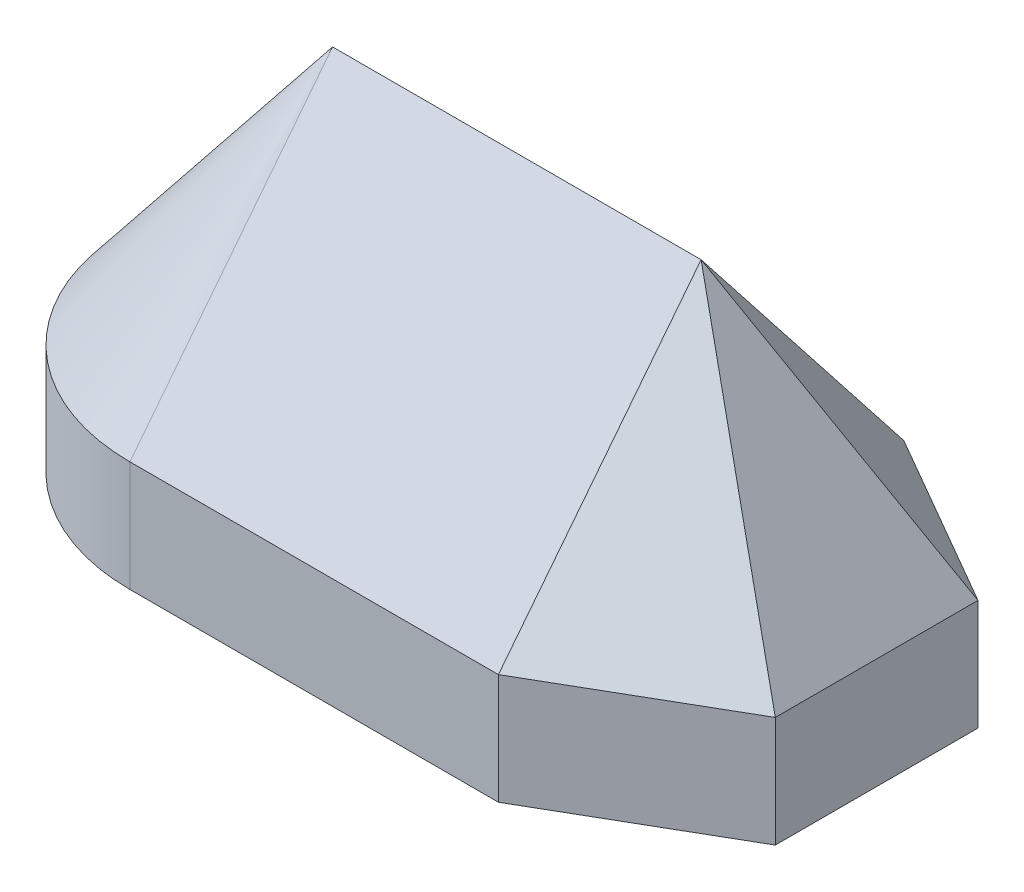
ISO-10303-21;
HEADER;
FILE_DESCRIPTION(('STEP AP214'),'2;1');
FILE_NAME('part.step','',(''),(''),'','','');
FILE_SCHEMA(('AUTOMOTIVE_DESIGN { 1 0 10303 214 1 1 1 1 }'));
ENDSEC;
DATA;
#1=APPLICATION_CONTEXT('core data for automotive mechanical design processes');
#2=APPLICATION_PROTOCOL_DEFINITION('international standard','automotive_design',2000,#1);
#3=PRODUCT_CONTEXT('',#1,'mechanical');
#4=PRODUCT('Part','Part','',(#3));
#5=PRODUCT_RELATED_PRODUCT_CATEGORY('part','',(#4));
#6=PRODUCT_DEFINITION_FORMATION('','',#4);
#7=PRODUCT_DEFINITION_CONTEXT('part definition',#1,'design');
#8=PRODUCT_DEFINITION('design','',#6,#7);
#9=PRODUCT_DEFINITION_SHAPE('','',#8);
#10=(LENGTH_UNIT() NAMED_UNIT(*) SI_UNIT(.MILLI.,.METRE.));
#11=(NAMED_UNIT(*) PLANE_ANGLE_UNIT() SI_UNIT($,.RADIAN.));
#12=(NAMED_UNIT(*) SI_UNIT($,.STERADIAN.) SOLID_ANGLE_UNIT());
#13=UNCERTAINTY_MEASURE_WITH_UNIT(LENGTH_MEASURE(1.E-05),#10,'distance_accuracy_value','');
#14=(GEOMETRIC_REPRESENTATION_CONTEXT(3) GLOBAL_UNCERTAINTY_ASSIGNED_CONTEXT((#13)) GLOBAL_UNIT_ASSIGNED_CONTEXT((#10,
#11,#12)) REPRESENTATION_CONTEXT('',''));
#15=CARTESIAN_POINT('',(0.,0.,0.));
#16=DIRECTION('',(0.,0.,1.));
#17=DIRECTION('',(1.,0.,0.));
#18=AXIS2_PLACEMENT_3D('',#15,#16,#17);
#19=CARTESIAN_POINT('',(0.,12.,0.));
#20=DIRECTION('',(0.,-1.,0.));
#21=DIRECTION('',(0.,0.,-1.));
#22=AXIS2_PLACEMENT_3D('',#19,#20,#21);
#23=CYLINDRICAL_SURFACE('',#22,22.);
#24=CARTESIAN_POINT('',(0.,0.,0.));
#25=DIRECTION('',(0.,1.,0.));
#26=DIRECTION('',(0.,0.,1.));
#27=AXIS2_PLACEMENT_3D('',#24,#25,#26);
#28=CIRCLE('',#27,22.);
#29=CARTESIAN_POINT('',(0.,0.,-22.));
#30=VERTEX_POINT('',#29);
#31=CARTESIAN_POINT('',(0.,0.,22.));
#32=VERTEX_POINT('',#31);
#33=EDGE_CURVE('E120',#30,#32,#28,.T.);
#34=ORIENTED_EDGE('',*,*,#33,.T.);
#35=DIRECTION('',(0.,-1.,0.));
#36=VECTOR('',#35,1.);
#37=CARTESIAN_POINT('',(0.,12.,22.));
#38=LINE('',#37,#36);
#39=CARTESIAN_POINT('',(0.,12.,22.));
#40=VERTEX_POINT('',#39);
#41=EDGE_CURVE('E12',#40,#32,#38,.T.);
#42=ORIENTED_EDGE('',*,*,#41,.F.);
#43=CARTESIAN_POINT('',(0.,12.,0.));
#44=DIRECTION('',(0.,1.,0.));
#45=DIRECTION('',(0.,0.,1.));
#46=AXIS2_PLACEMENT_3D('',#43,#44,#45);
#47=CIRCLE('',#46,22.);
#48=CARTESIAN_POINT('',(1.53625178909098E-13,12.,-22.));
#49=VERTEX_POINT('',#48);
#50=EDGE_CURVE('E94',#49,#40,#47,.T.);
#51=ORIENTED_EDGE('',*,*,#50,.F.);
#52=DIRECTION('',(0.,-1.,0.));
#53=VECTOR('',#52,1.);
#54=CARTESIAN_POINT('',(0.,12.,-22.));
#55=LINE('',#54,#53);
#56=EDGE_CURVE('E144',#49,#30,#55,.T.);
#57=ORIENTED_EDGE('',*,*,#56,.T.);
#58=EDGE_LOOP('',(#34,#42,#51,#57));
#59=FACE_BOUND('',#58,.T.);
#60=ADVANCED_FACE('F34',(#59),#23,.T.);
#61=CARTESIAN_POINT('',(0.,12.,22.));
#62=DIRECTION('',(0.,0.,-1.));
#63=DIRECTION('',(-1.,0.,0.));
#64=AXIS2_PLACEMENT_3D('',#61,#62,#63);
#65=PLANE('',#64);
#66=DIRECTION('',(1.,0.,0.));
#67=VECTOR('',#66,1.);
#68=CARTESIAN_POINT('',(0.,0.,22.));
#69=LINE('',#68,#67);
#70=CARTESIAN_POINT('',(40.,0.,22.));
#71=VERTEX_POINT('',#70);
#72=EDGE_CURVE('E135',#32,#71,#69,.T.);
#73=ORIENTED_EDGE('',*,*,#72,.T.);
#74=DIRECTION('',(0.,-1.,0.));
#75=VECTOR('',#74,1.);
#76=CARTESIAN_POINT('',(40.,12.,22.));
#77=LINE('',#76,#75);
#78=CARTESIAN_POINT('',(40.0000000000001,12.,22.));
#79=VERTEX_POINT('',#78);
#80=EDGE_CURVE('E42',#79,#71,#77,.T.);
#81=ORIENTED_EDGE('',*,*,#80,.F.);
#82=DIRECTION('',(1.,0.,0.));
#83=VECTOR('',#82,1.);
#84=CARTESIAN_POINT('',(0.,12.,22.));
#85=LINE('',#84,#83);
#86=EDGE_CURVE('E107',#40,#79,#85,.T.);
#87=ORIENTED_EDGE('',*,*,#86,.F.);
#88=ORIENTED_EDGE('',*,*,#41,.T.);
#89=EDGE_LOOP('',(#73,#81,#87,#88));
#90=FACE_BOUND('',#89,.T.);
#91=ADVANCED_FACE('F112',(#90),#65,.F.);
#92=CARTESIAN_POINT('',(40.,12.,22.));
#93=DIRECTION('',(-0.500000000000004,0.,-0.866025403784436));
#94=DIRECTION('',(-0.866025403784436,0.,0.500000000000004));
#95=AXIS2_PLACEMENT_3D('',#92,#93,#94);
#96=PLANE('',#95);
#97=DIRECTION('',(0.866025403784436,0.,-0.500000000000004));
#98=VECTOR('',#97,1.);
#99=CARTESIAN_POINT('',(40.,0.,22.));
#100=LINE('',#99,#98);
#101=CARTESIAN_POINT('',(59.0525588832578,0.,10.9999999999998));
#102=VERTEX_POINT('',#101);
#103=EDGE_CURVE('E137',#71,#102,#100,.T.);
#104=ORIENTED_EDGE('',*,*,#103,.T.);
#105=DIRECTION('',(0.,-1.,0.));
#106=VECTOR('',#105,1.);
#107=CARTESIAN_POINT('',(59.0525588832578,12.,10.9999999999998));
#108=LINE('',#107,#106);
#109=CARTESIAN_POINT('',(59.0525588832577,12.,10.9999999999998));
#110=VERTEX_POINT('',#109);
#111=EDGE_CURVE('E58',#110,#102,#108,.T.);
#112=ORIENTED_EDGE('',*,*,#111,.F.);
#113=DIRECTION('',(0.866025403784434,0.,-0.500000000000008));
#114=VECTOR('',#113,1.);
#115=CARTESIAN_POINT('',(39.9999999999998,12.,22.0000000000002));
#116=LINE('',#115,#114);
#117=EDGE_CURVE('E117',#79,#110,#116,.T.);
#118=ORIENTED_EDGE('',*,*,#117,.F.);
#119=ORIENTED_EDGE('',*,*,#80,.T.);
#120=EDGE_LOOP('',(#104,#112,#118,#119));
#121=FACE_BOUND('',#120,.T.);
#122=ADVANCED_FACE('F183',(#121),#96,.F.);
#123=CARTESIAN_POINT('',(59.0525588832578,12.,10.9999999999998));
#124=DIRECTION('',(-1.,0.,0.));
#125=DIRECTION('',(0.,0.,1.));
#126=AXIS2_PLACEMENT_3D('',#123,#124,#125);
#127=PLANE('',#126);
#128=DIRECTION('',(0.,0.,-1.));
#129=VECTOR('',#128,1.);
#130=CARTESIAN_POINT('',(59.0525588832578,0.,10.9999999999998));
#131=LINE('',#130,#129);
#132=CARTESIAN_POINT('',(59.0525588832575,0.,-11.0000000000002));
#133=VERTEX_POINT('',#132);
#134=EDGE_CURVE('E139',#102,#133,#131,.T.);
#135=ORIENTED_EDGE('',*,*,#134,.T.);
#136=DIRECTION('',(0.,-1.,0.));
#137=VECTOR('',#136,1.);
#138=CARTESIAN_POINT('',(59.0525588832575,12.,-11.0000000000002));
#139=LINE('',#138,#137);
#140=CARTESIAN_POINT('',(59.0525588832575,12.,-11.0000000000002));
#141=VERTEX_POINT('',#140);
#142=EDGE_CURVE('E50',#141,#133,#139,.T.);
#143=ORIENTED_EDGE('',*,*,#142,.F.);
#144=DIRECTION('',(0.,0.,1.));
#145=VECTOR('',#144,1.);
#146=CARTESIAN_POINT('',(59.0525588832578,12.,10.9999999999998));
#147=LINE('',#146,#145);
#148=EDGE_CURVE('E37',#110,#141,#147,.F.);
#149=ORIENTED_EDGE('',*,*,#148,.F.);
#150=ORIENTED_EDGE('',*,*,#111,.T.);
#151=EDGE_LOOP('',(#135,#143,#149,#150));
#152=FACE_BOUND('',#151,.T.);
#153=ADVANCED_FACE('F201',(#152),#127,.F.);
#154=CARTESIAN_POINT('',(59.0525588832575,12.,-11.0000000000002));
#155=DIRECTION('',(-0.499999999999995,0.,0.866025403784442));
#156=DIRECTION('',(0.866025403784442,0.,0.499999999999995));
#157=AXIS2_PLACEMENT_3D('',#154,#155,#156);
#158=PLANE('',#157);
#159=DIRECTION('',(-0.866025403784441,0.,-0.499999999999995));
#160=VECTOR('',#159,1.);
#161=CARTESIAN_POINT('',(59.0525588832575,0.,-11.0000000000002));
#162=LINE('',#161,#160);
#163=CARTESIAN_POINT('',(40.,0.,-22.));
#164=VERTEX_POINT('',#163);
#165=EDGE_CURVE('E141',#133,#164,#162,.T.);
#166=ORIENTED_EDGE('',*,*,#165,.T.);
#167=DIRECTION('',(0.,-1.,0.));
#168=VECTOR('',#167,1.);
#169=CARTESIAN_POINT('',(40.,12.,-22.));
#170=LINE('',#169,#168);
#171=CARTESIAN_POINT('',(39.9999999999999,12.,-22.));
#172=VERTEX_POINT('',#171);
#173=EDGE_CURVE('E145',#172,#164,#170,.T.);
#174=ORIENTED_EDGE('',*,*,#173,.F.);
#175=DIRECTION('',(-0.866025403784445,0.,-0.499999999999989));
#176=VECTOR('',#175,1.);
#177=CARTESIAN_POINT('',(59.0525588832575,12.,-11.0000000000002));
#178=LINE('',#177,#176);
#179=EDGE_CURVE('E151',#141,#172,#178,.T.);
#180=ORIENTED_EDGE('',*,*,#179,.F.);
#181=ORIENTED_EDGE('',*,*,#142,.T.);
#182=EDGE_LOOP('',(#166,#174,#180,#181));
#183=FACE_BOUND('',#182,.T.);
#184=ADVANCED_FACE('F174',(#183),#158,.F.);
#185=CARTESIAN_POINT('',(0.,12.,-22.));
#186=DIRECTION('',(0.,0.,1.));
#187=DIRECTION('',(1.,0.,0.));
#188=AXIS2_PLACEMENT_3D('',#185,#186,#187);
#189=PLANE('',#188);
#190=DIRECTION('',(-1.,0.,0.));
#191=VECTOR('',#190,1.);
#192=CARTESIAN_POINT('',(0.,0.,-22.));
#193=LINE('',#192,#191);
#194=EDGE_CURVE('E108',#164,#30,#193,.T.);
#195=ORIENTED_EDGE('',*,*,#194,.T.);
#196=ORIENTED_EDGE('',*,*,#56,.F.);
#197=DIRECTION('',(-1.,0.,0.));
#198=VECTOR('',#197,1.);
#199=CARTESIAN_POINT('',(0.,12.,-22.));
#200=LINE('',#199,#198);
#201=EDGE_CURVE('E146',#172,#49,#200,.T.);
#202=ORIENTED_EDGE('',*,*,#201,.F.);
#203=ORIENTED_EDGE('',*,*,#173,.T.);
#204=EDGE_LOOP('',(#195,#196,#202,#203));
#205=FACE_BOUND('',#204,.T.);
#206=ADVANCED_FACE('F178',(#205),#189,.F.);
#207=CARTESIAN_POINT('',(0.,0.,0.));
#208=DIRECTION('',(0.,1.,0.));
#209=DIRECTION('',(0.,0.,1.));
#210=AXIS2_PLACEMENT_3D('',#207,#208,#209);
#211=PLANE('',#210);
#212=ORIENTED_EDGE('',*,*,#33,.F.);
#213=ORIENTED_EDGE('',*,*,#194,.F.);
#214=ORIENTED_EDGE('',*,*,#165,.F.);
#215=ORIENTED_EDGE('',*,*,#134,.F.);
#216=ORIENTED_EDGE('',*,*,#103,.F.);
#217=ORIENTED_EDGE('',*,*,#72,.F.);
#218=EDGE_LOOP('',(#212,#213,#214,#215,#216,#217));
#219=FACE_BOUND('',#218,.T.);
#220=ADVANCED_FACE('F180',(#219),#211,.F.);
#221=CARTESIAN_POINT('',(40.,12.,-22.));
#222=DIRECTION('',(0.,-0.617821551931904,0.786318338822423));
#223=DIRECTION('',(0.,-0.786318338822423,-0.617821551931904));
#224=AXIS2_PLACEMENT_3D('',#221,#222,#223);
#225=PLANE('',#224);
#226=DIRECTION('',(0.,0.786318338822423,0.617821551931903));
#227=VECTOR('',#226,1.);
#228=CARTESIAN_POINT('',(0.,12.,-22.));
#229=LINE('',#228,#227);
#230=CARTESIAN_POINT('',(0.,40.,0.));
#231=VERTEX_POINT('',#230);
#232=EDGE_CURVE('E101',#49,#231,#229,.T.);
#233=ORIENTED_EDGE('',*,*,#232,.T.);
#234=DIRECTION('',(-1.,0.,0.));
#235=VECTOR('',#234,1.);
#236=CARTESIAN_POINT('',(40.,40.,0.));
#237=LINE('',#236,#235);
#238=CARTESIAN_POINT('',(40.,40.,0.));
#239=VERTEX_POINT('',#238);
#240=EDGE_CURVE('E123',#239,#231,#237,.T.);
#241=ORIENTED_EDGE('',*,*,#240,.F.);
#242=DIRECTION('',(0.,0.786318338822423,0.617821551931903));
#243=VECTOR('',#242,1.);
#244=CARTESIAN_POINT('',(40.,12.,-22.));
#245=LINE('',#244,#243);
#246=EDGE_CURVE('E124',#172,#239,#245,.T.);
#247=ORIENTED_EDGE('',*,*,#246,.F.);
#248=ORIENTED_EDGE('',*,*,#201,.T.);
#249=EDGE_LOOP('',(#233,#241,#247,#248));
#250=FACE_BOUND('',#249,.T.);
#251=ADVANCED_FACE('F171',(#250),#225,.F.);
#252=CARTESIAN_POINT('',(40.,40.,0.));
#253=DIRECTION('',(0.,-0.617821551931904,-0.786318338822423));
#254=DIRECTION('',(0.,0.786318338822423,-0.617821551931904));
#255=AXIS2_PLACEMENT_3D('',#252,#253,#254);
#256=PLANE('',#255);
#257=DIRECTION('',(0.,-0.786318338822423,0.617821551931903));
#258=VECTOR('',#257,1.);
#259=CARTESIAN_POINT('',(0.,40.,0.));
#260=LINE('',#259,#258);
#261=EDGE_CURVE('E98',#231,#40,#260,.T.);
#262=ORIENTED_EDGE('',*,*,#261,.T.);
#263=ORIENTED_EDGE('',*,*,#86,.T.);
#264=DIRECTION('',(0.,-0.786318338822423,0.617821551931903));
#265=VECTOR('',#264,1.);
#266=CARTESIAN_POINT('',(40.,40.,0.));
#267=LINE('',#266,#265);
#268=EDGE_CURVE('E127',#239,#79,#267,.T.);
#269=ORIENTED_EDGE('',*,*,#268,.F.);
#270=ORIENTED_EDGE('',*,*,#240,.T.);
#271=EDGE_LOOP('',(#262,#263,#269,#270));
#272=FACE_BOUND('',#271,.T.);
#273=ADVANCED_FACE('F121',(#272),#256,.F.);
#274=CARTESIAN_POINT('',(0.,12.,0.));
#275=DIRECTION('',(0.,-1.,0.));
#276=DIRECTION('',(0.,0.,-1.));
#277=AXIS2_PLACEMENT_3D('',#274,#275,#276);
#278=CONICAL_SURFACE('',#277,22.,0.66596923737911);
#279=ORIENTED_EDGE('',*,*,#50,.T.);
#280=ORIENTED_EDGE('',*,*,#261,.F.);
#281=ORIENTED_EDGE('',*,*,#232,.F.);
#282=EDGE_LOOP('',(#279,#280,#281));
#283=FACE_BOUND('',#282,.T.);
#284=ADVANCED_FACE('F96',(#283),#278,.T.);
#285=CARTESIAN_POINT('',(59.0525588832575,12.,-11.0000000000002));
#286=DIRECTION('',(0.413377016750236,0.562563568044244,-0.71598999569268));
#287=DIRECTION('',(0.,0.786318338822425,0.6178215519319));
#288=AXIS2_PLACEMENT_3D('',#285,#286,#287);
#289=PLANE('',#288);
#290=DIRECTION('',(0.535049158978552,-0.786318338822423,-0.308910775965958));
#291=VECTOR('',#290,1.);
#292=CARTESIAN_POINT('',(40.,40.,0.));
#293=LINE('',#292,#291);
#294=EDGE_CURVE('E129',#239,#141,#293,.T.);
#295=ORIENTED_EDGE('',*,*,#294,.T.);
#296=ORIENTED_EDGE('',*,*,#179,.T.);
#297=ORIENTED_EDGE('',*,*,#246,.T.);
#298=EDGE_LOOP('',(#295,#296,#297));
#299=FACE_BOUND('',#298,.T.);
#300=ADVANCED_FACE('F167',(#299),#289,.T.);
#301=CARTESIAN_POINT('',(59.0525588832578,12.,10.9999999999998));
#302=DIRECTION('',(0.82675403350049,0.562563568044244,0.));
#303=DIRECTION('',(-0.562563568044244,0.82675403350049,0.));
#304=AXIS2_PLACEMENT_3D('',#301,#302,#303);
#305=PLANE('',#304);
#306=DIRECTION('',(0.535049158978558,-0.786318338822423,0.308910775965947));
#307=VECTOR('',#306,1.);
#308=CARTESIAN_POINT('',(40.,40.,0.));
#309=LINE('',#308,#307);
#310=EDGE_CURVE('E166',#239,#110,#309,.T.);
#311=ORIENTED_EDGE('',*,*,#310,.T.);
#312=ORIENTED_EDGE('',*,*,#148,.T.);
#313=ORIENTED_EDGE('',*,*,#294,.F.);
#314=EDGE_LOOP('',(#311,#312,#313));
#315=FACE_BOUND('',#314,.T.);
#316=ADVANCED_FACE('F164',(#315),#305,.T.);
#317=CARTESIAN_POINT('',(39.9999999999998,12.,22.0000000000002));
#318=DIRECTION('',(0.413377016750252,0.562563568044244,0.715989995692671));
#319=DIRECTION('',(0.,-0.786318338822421,0.617821551931905));
#320=AXIS2_PLACEMENT_3D('',#317,#318,#319);
#321=PLANE('',#320);
#322=ORIENTED_EDGE('',*,*,#268,.T.);
#323=ORIENTED_EDGE('',*,*,#117,.T.);
#324=ORIENTED_EDGE('',*,*,#310,.F.);
#325=EDGE_LOOP('',(#322,#323,#324));
#326=FACE_BOUND('',#325,.T.);
#327=ADVANCED_FACE('F185',(#326),#321,.T.);
#328=CLOSED_SHELL('',(#60,#91,#122,#153,#184,#206,#220,#251,#273,#284,#300,#316,#327));
#329=MANIFOLD_SOLID_BREP('B2',#328);
#330=ADVANCED_BREP_SHAPE_REPRESENTATION('',(#18,#329),#14);
#331=SHAPE_DEFINITION_REPRESENTATION(#9,#330);
ENDSEC;
END-ISO-10303-21;
